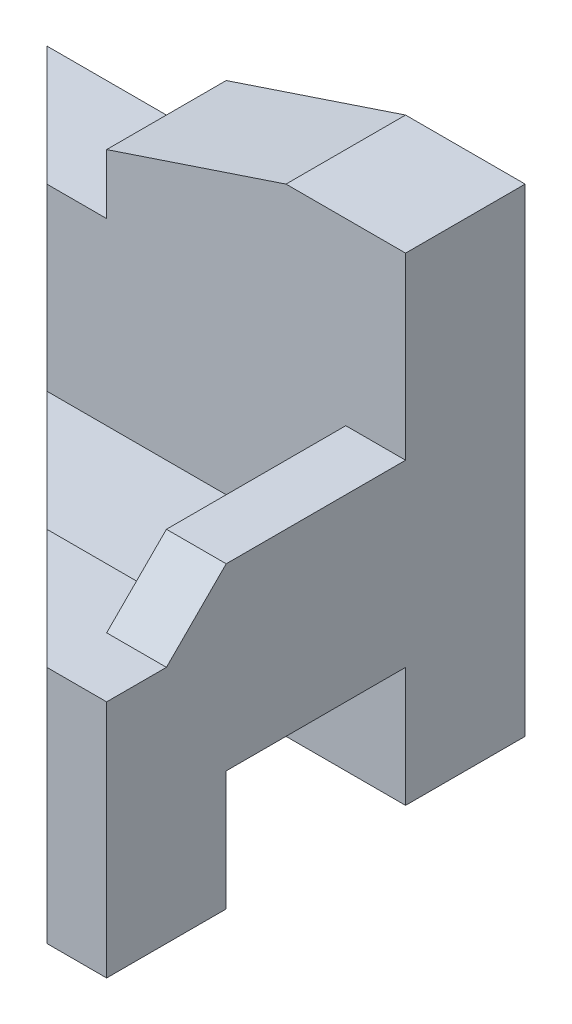
ISO-10303-21;
HEADER;
FILE_DESCRIPTION(('STEP AP214'),'2;1');
FILE_NAME('part.step','',(''),(''),'','','');
FILE_SCHEMA(('AUTOMOTIVE_DESIGN { 1 0 10303 214 1 1 1 1 }'));
ENDSEC;
DATA;
#1=APPLICATION_CONTEXT('core data for automotive mechanical design processes');
#2=APPLICATION_PROTOCOL_DEFINITION('international standard','automotive_design',2000,#1);
#3=PRODUCT_CONTEXT('',#1,'mechanical');
#4=PRODUCT('Part','Part','',(#3));
#5=PRODUCT_RELATED_PRODUCT_CATEGORY('part','',(#4));
#6=PRODUCT_DEFINITION_FORMATION('','',#4);
#7=PRODUCT_DEFINITION_CONTEXT('part definition',#1,'design');
#8=PRODUCT_DEFINITION('design','',#6,#7);
#9=PRODUCT_DEFINITION_SHAPE('','',#8);
#10=(LENGTH_UNIT() NAMED_UNIT(*) SI_UNIT(.MILLI.,.METRE.));
#11=(NAMED_UNIT(*) PLANE_ANGLE_UNIT() SI_UNIT($,.RADIAN.));
#12=(NAMED_UNIT(*) SI_UNIT($,.STERADIAN.) SOLID_ANGLE_UNIT());
#13=UNCERTAINTY_MEASURE_WITH_UNIT(LENGTH_MEASURE(1.E-05),#10,'distance_accuracy_value','');
#14=(GEOMETRIC_REPRESENTATION_CONTEXT(3) GLOBAL_UNCERTAINTY_ASSIGNED_CONTEXT((#13)) GLOBAL_UNIT_ASSIGNED_CONTEXT((#10,
#11,#12)) REPRESENTATION_CONTEXT('',''));
#15=CARTESIAN_POINT('',(0.,0.,0.));
#16=DIRECTION('',(0.,0.,1.));
#17=DIRECTION('',(1.,0.,0.));
#18=AXIS2_PLACEMENT_3D('',#15,#16,#17);
#19=CARTESIAN_POINT('',(0.,0.,10.));
#20=DIRECTION('',(0.,0.,1.));
#21=DIRECTION('',(1.,0.,0.));
#22=AXIS2_PLACEMENT_3D('',#19,#20,#21);
#23=PLANE('',#22);
#24=DIRECTION('',(0.,-1.,0.));
#25=VECTOR('',#24,1.);
#26=CARTESIAN_POINT('',(15.,4.99999999999999,10.));
#27=LINE('',#26,#25);
#28=CARTESIAN_POINT('',(15.,4.99999999999999,10.));
#29=VERTEX_POINT('',#28);
#30=CARTESIAN_POINT('',(15.,-5.,10.));
#31=VERTEX_POINT('',#30);
#32=EDGE_CURVE('E290',#29,#31,#27,.T.);
#33=ORIENTED_EDGE('',*,*,#32,.F.);
#34=DIRECTION('',(-1.,0.,0.));
#35=VECTOR('',#34,1.);
#36=CARTESIAN_POINT('',(20.,5.,10.));
#37=LINE('',#36,#35);
#38=CARTESIAN_POINT('',(20.,5.,10.));
#39=VERTEX_POINT('',#38);
#40=EDGE_CURVE('E289',#39,#29,#37,.T.);
#41=ORIENTED_EDGE('',*,*,#40,.F.);
#42=DIRECTION('',(0.,1.,0.));
#43=VECTOR('',#42,1.);
#44=CARTESIAN_POINT('',(20.,20.,10.));
#45=LINE('',#44,#43);
#46=CARTESIAN_POINT('',(20.,20.,10.));
#47=VERTEX_POINT('',#46);
#48=EDGE_CURVE('E37',#39,#47,#45,.T.);
#49=ORIENTED_EDGE('',*,*,#48,.T.);
#50=DIRECTION('',(-1.,0.,0.));
#51=VECTOR('',#50,1.);
#52=CARTESIAN_POINT('',(-20.,20.,10.));
#53=LINE('',#52,#51);
#54=CARTESIAN_POINT('',(10.,20.,10.));
#55=VERTEX_POINT('',#54);
#56=EDGE_CURVE('E247',#47,#55,#53,.T.);
#57=ORIENTED_EDGE('',*,*,#56,.T.);
#58=DIRECTION('',(0.948683298050514,0.316227766016838,0.));
#59=VECTOR('',#58,1.);
#60=CARTESIAN_POINT('',(10.,20.,10.));
#61=LINE('',#60,#59);
#62=CARTESIAN_POINT('',(-5.,15.,10.));
#63=VERTEX_POINT('',#62);
#64=EDGE_CURVE('E234',#63,#55,#61,.T.);
#65=ORIENTED_EDGE('',*,*,#64,.F.);
#66=DIRECTION('',(0.,1.,0.));
#67=VECTOR('',#66,1.);
#68=CARTESIAN_POINT('',(-5.,15.,10.));
#69=LINE('',#68,#67);
#70=CARTESIAN_POINT('',(-5.,9.99999999999999,10.));
#71=VERTEX_POINT('',#70);
#72=EDGE_CURVE('E181',#71,#63,#69,.T.);
#73=ORIENTED_EDGE('',*,*,#72,.F.);
#74=DIRECTION('',(1.,0.,0.));
#75=VECTOR('',#74,1.);
#76=CARTESIAN_POINT('',(-5.,9.99999999999999,10.));
#77=LINE('',#76,#75);
#78=CARTESIAN_POINT('',(-9.99999999999999,9.99999999999999,10.));
#79=VERTEX_POINT('',#78);
#80=EDGE_CURVE('E179',#79,#71,#77,.T.);
#81=ORIENTED_EDGE('',*,*,#80,.F.);
#82=DIRECTION('',(0.,1.,0.));
#83=VECTOR('',#82,1.);
#84=CARTESIAN_POINT('',(-10.,0.,10.));
#85=LINE('',#84,#83);
#86=CARTESIAN_POINT('',(-10.,-5.,10.));
#87=VERTEX_POINT('',#86);
#88=EDGE_CURVE('E319',#87,#79,#85,.T.);
#89=ORIENTED_EDGE('',*,*,#88,.F.);
#90=DIRECTION('',(-1.,0.,0.));
#91=VECTOR('',#90,1.);
#92=CARTESIAN_POINT('',(20.00005,-5.,10.));
#93=LINE('',#92,#91);
#94=EDGE_CURVE('E214',#31,#87,#93,.T.);
#95=ORIENTED_EDGE('',*,*,#94,.F.);
#96=EDGE_LOOP('',(#33,#41,#49,#57,#65,#73,#81,#89,#95));
#97=FACE_BOUND('',#96,.T.);
#98=ADVANCED_FACE('F33',(#97),#23,.T.);
#99=CARTESIAN_POINT('',(-20.,0.,35.));
#100=DIRECTION('',(0.,-1.,0.));
#101=DIRECTION('',(0.,0.,-1.));
#102=AXIS2_PLACEMENT_3D('',#99,#100,#101);
#103=PLANE('',#102);
#104=DIRECTION('',(0.,0.,1.));
#105=VECTOR('',#104,1.);
#106=CARTESIAN_POINT('',(15.,0.,35.));
#107=LINE('',#106,#105);
#108=CARTESIAN_POINT('',(15.,0.,25.));
#109=VERTEX_POINT('',#108);
#110=CARTESIAN_POINT('',(15.,0.,30.));
#111=VERTEX_POINT('',#110);
#112=EDGE_CURVE('E199',#109,#111,#107,.T.);
#113=ORIENTED_EDGE('',*,*,#112,.F.);
#114=DIRECTION('',(-1.,0.,0.));
#115=VECTOR('',#114,1.);
#116=CARTESIAN_POINT('',(-20.,0.,25.));
#117=LINE('',#116,#115);
#118=CARTESIAN_POINT('',(5.,0.,25.));
#119=VERTEX_POINT('',#118);
#120=EDGE_CURVE('E191',#109,#119,#117,.T.);
#121=ORIENTED_EDGE('',*,*,#120,.T.);
#122=DIRECTION('',(0.707106781186547,0.,0.707106781186548));
#123=VECTOR('',#122,1.);
#124=CARTESIAN_POINT('',(-2.5,0.,17.5));
#125=LINE('',#124,#123);
#126=CARTESIAN_POINT('',(15.,0.,35.));
#127=VERTEX_POINT('',#126);
#128=EDGE_CURVE('E317',#119,#127,#125,.T.);
#129=ORIENTED_EDGE('',*,*,#128,.T.);
#130=DIRECTION('',(-1.,0.,0.));
#131=VECTOR('',#130,1.);
#132=CARTESIAN_POINT('',(-20.,0.,35.));
#133=LINE('',#132,#131);
#134=CARTESIAN_POINT('',(20.,0.,35.));
#135=VERTEX_POINT('',#134);
#136=EDGE_CURVE('E178',#135,#127,#133,.T.);
#137=ORIENTED_EDGE('',*,*,#136,.F.);
#138=DIRECTION('',(0.,0.,-1.));
#139=VECTOR('',#138,1.);
#140=CARTESIAN_POINT('',(20.,0.,35.));
#141=LINE('',#140,#139);
#142=CARTESIAN_POINT('',(20.,0.,30.));
#143=VERTEX_POINT('',#142);
#144=EDGE_CURVE('E169',#135,#143,#141,.T.);
#145=ORIENTED_EDGE('',*,*,#144,.T.);
#146=DIRECTION('',(-1.,0.,0.));
#147=VECTOR('',#146,1.);
#148=CARTESIAN_POINT('',(-20.,0.,30.));
#149=LINE('',#148,#147);
#150=EDGE_CURVE('E11',#143,#111,#149,.T.);
#151=ORIENTED_EDGE('',*,*,#150,.T.);
#152=EDGE_LOOP('',(#113,#121,#129,#137,#145,#151));
#153=FACE_BOUND('',#152,.T.);
#154=ADVANCED_FACE('F175',(#153),#103,.F.);
#155=CARTESIAN_POINT('',(20.00005,-5.,10.));
#156=DIRECTION('',(0.,-1.,0.));
#157=DIRECTION('',(0.,0.,-1.));
#158=AXIS2_PLACEMENT_3D('',#155,#156,#157);
#159=PLANE('',#158);
#160=DIRECTION('',(0.,0.,-1.));
#161=VECTOR('',#160,1.);
#162=CARTESIAN_POINT('',(15.,-5.,30.));
#163=LINE('',#162,#161);
#164=CARTESIAN_POINT('',(15.,-5.,25.));
#165=VERTEX_POINT('',#164);
#166=EDGE_CURVE('E200',#165,#31,#163,.T.);
#167=ORIENTED_EDGE('',*,*,#166,.T.);
#168=ORIENTED_EDGE('',*,*,#94,.T.);
#169=DIRECTION('',(0.707106781186547,0.,0.707106781186548));
#170=VECTOR('',#169,1.);
#171=CARTESIAN_POINT('',(5.000025,-5.,25.000025));
#172=LINE('',#171,#170);
#173=CARTESIAN_POINT('',(5.,-5.,25.));
#174=VERTEX_POINT('',#173);
#175=EDGE_CURVE('E212',#87,#174,#172,.T.);
#176=ORIENTED_EDGE('',*,*,#175,.T.);
#177=DIRECTION('',(-1.,0.,0.));
#178=VECTOR('',#177,1.);
#179=CARTESIAN_POINT('',(20.00005,-5.,25.));
#180=LINE('',#179,#178);
#181=EDGE_CURVE('E205',#165,#174,#180,.T.);
#182=ORIENTED_EDGE('',*,*,#181,.F.);
#183=EDGE_LOOP('',(#167,#168,#176,#182));
#184=FACE_BOUND('',#183,.T.);
#185=ADVANCED_FACE('F209',(#184),#159,.F.);
#186=CARTESIAN_POINT('',(20.00005,-5.,25.));
#187=DIRECTION('',(0.,0.,1.));
#188=DIRECTION('',(1.,0.,0.));
#189=AXIS2_PLACEMENT_3D('',#186,#187,#188);
#190=PLANE('',#189);
#191=DIRECTION('',(0.,1.,0.));
#192=VECTOR('',#191,1.);
#193=CARTESIAN_POINT('',(15.,-5.,25.));
#194=LINE('',#193,#192);
#195=EDGE_CURVE('E43',#165,#109,#194,.T.);
#196=ORIENTED_EDGE('',*,*,#195,.F.);
#197=ORIENTED_EDGE('',*,*,#181,.T.);
#198=DIRECTION('',(0.,1.,0.));
#199=VECTOR('',#198,1.);
#200=CARTESIAN_POINT('',(5.,-5.00000000000001,25.));
#201=LINE('',#200,#199);
#202=EDGE_CURVE('E314',#174,#119,#201,.T.);
#203=ORIENTED_EDGE('',*,*,#202,.T.);
#204=ORIENTED_EDGE('',*,*,#120,.F.);
#205=EDGE_LOOP('',(#196,#197,#203,#204));
#206=FACE_BOUND('',#205,.T.);
#207=ADVANCED_FACE('F203',(#206),#190,.F.);
#208=CARTESIAN_POINT('',(-20.,-20.,10.));
#209=DIRECTION('',(0.,1.,0.));
#210=DIRECTION('',(0.,0.,1.));
#211=AXIS2_PLACEMENT_3D('',#208,#209,#210);
#212=PLANE('',#211);
#213=DIRECTION('',(-1.,0.,0.));
#214=VECTOR('',#213,1.);
#215=CARTESIAN_POINT('',(20.,-20.,10.));
#216=LINE('',#215,#214);
#217=CARTESIAN_POINT('',(20.,-20.,10.));
#218=VERTEX_POINT('',#217);
#219=CARTESIAN_POINT('',(-9.99999999999999,-20.,10.));
#220=VERTEX_POINT('',#219);
#221=EDGE_CURVE('E217',#218,#220,#216,.T.);
#222=ORIENTED_EDGE('',*,*,#221,.T.);
#223=DIRECTION('',(-0.707106781186548,0.,-0.707106781186548));
#224=VECTOR('',#223,1.);
#225=CARTESIAN_POINT('',(-20.,-20.,0.));
#226=LINE('',#225,#224);
#227=CARTESIAN_POINT('',(-20.,-20.,0.));
#228=VERTEX_POINT('',#227);
#229=EDGE_CURVE('E277',#220,#228,#226,.T.);
#230=ORIENTED_EDGE('',*,*,#229,.T.);
#231=DIRECTION('',(1.,0.,0.));
#232=VECTOR('',#231,1.);
#233=CARTESIAN_POINT('',(-20.,-20.,0.));
#234=LINE('',#233,#232);
#235=CARTESIAN_POINT('',(20.,-20.,0.));
#236=VERTEX_POINT('',#235);
#237=EDGE_CURVE('E258',#228,#236,#234,.T.);
#238=ORIENTED_EDGE('',*,*,#237,.T.);
#239=DIRECTION('',(0.,0.,-1.));
#240=VECTOR('',#239,1.);
#241=CARTESIAN_POINT('',(20.,-20.,10.));
#242=LINE('',#241,#240);
#243=EDGE_CURVE('E250',#218,#236,#242,.T.);
#244=ORIENTED_EDGE('',*,*,#243,.F.);
#245=EDGE_LOOP('',(#222,#230,#238,#244));
#246=FACE_BOUND('',#245,.T.);
#247=ADVANCED_FACE('F276',(#246),#212,.F.);
#248=CARTESIAN_POINT('',(-20.,20.,10.));
#249=DIRECTION('',(0.,-1.,0.));
#250=DIRECTION('',(0.,0.,-1.));
#251=AXIS2_PLACEMENT_3D('',#248,#249,#250);
#252=PLANE('',#251);
#253=DIRECTION('',(-1.,0.,0.));
#254=VECTOR('',#253,1.);
#255=CARTESIAN_POINT('',(-20.,20.,0.));
#256=LINE('',#255,#254);
#257=CARTESIAN_POINT('',(20.,20.,0.));
#258=VERTEX_POINT('',#257);
#259=CARTESIAN_POINT('',(10.,20.,0.));
#260=VERTEX_POINT('',#259);
#261=EDGE_CURVE('E253',#258,#260,#256,.T.);
#262=ORIENTED_EDGE('',*,*,#261,.T.);
#263=DIRECTION('',(0.,0.,1.));
#264=VECTOR('',#263,1.);
#265=CARTESIAN_POINT('',(10.,20.,0.));
#266=LINE('',#265,#264);
#267=EDGE_CURVE('E240',#260,#55,#266,.T.);
#268=ORIENTED_EDGE('',*,*,#267,.T.);
#269=ORIENTED_EDGE('',*,*,#56,.F.);
#270=DIRECTION('',(0.,0.,-1.));
#271=VECTOR('',#270,1.);
#272=CARTESIAN_POINT('',(20.,20.,10.));
#273=LINE('',#272,#271);
#274=EDGE_CURVE('E187',#47,#258,#273,.T.);
#275=ORIENTED_EDGE('',*,*,#274,.T.);
#276=EDGE_LOOP('',(#262,#268,#269,#275));
#277=FACE_BOUND('',#276,.T.);
#278=ADVANCED_FACE('F284',(#277),#252,.F.);
#279=CARTESIAN_POINT('',(20.,20.,10.));
#280=DIRECTION('',(-1.,0.,0.));
#281=DIRECTION('',(0.,0.,1.));
#282=AXIS2_PLACEMENT_3D('',#279,#280,#281);
#283=PLANE('',#282);
#284=DIRECTION('',(0.,0.,-1.));
#285=VECTOR('',#284,1.);
#286=CARTESIAN_POINT('',(20.,5.,30.));
#287=LINE('',#286,#285);
#288=CARTESIAN_POINT('',(20.,5.,25.));
#289=VERTEX_POINT('',#288);
#290=EDGE_CURVE('E172',#289,#39,#287,.T.);
#291=ORIENTED_EDGE('',*,*,#290,.F.);
#292=DIRECTION('',(0.,-0.707106781186547,0.707106781186548));
#293=VECTOR('',#292,1.);
#294=CARTESIAN_POINT('',(20.,0.,30.));
#295=LINE('',#294,#293);
#296=EDGE_CURVE('E50',#289,#143,#295,.T.);
#297=ORIENTED_EDGE('',*,*,#296,.T.);
#298=ORIENTED_EDGE('',*,*,#144,.F.);
#299=DIRECTION('',(0.,1.,0.));
#300=VECTOR('',#299,1.);
#301=CARTESIAN_POINT('',(20.,0.,35.));
#302=LINE('',#301,#300);
#303=CARTESIAN_POINT('',(20.,-20.,35.));
#304=VERTEX_POINT('',#303);
#305=EDGE_CURVE('E183',#304,#135,#302,.T.);
#306=ORIENTED_EDGE('',*,*,#305,.F.);
#307=CARTESIAN_POINT('',(20.,-20.,25.));
#308=VERTEX_POINT('',#307);
#309=EDGE_CURVE('E260',#304,#308,#242,.T.);
#310=ORIENTED_EDGE('',*,*,#309,.T.);
#311=DIRECTION('',(0.,1.,0.));
#312=VECTOR('',#311,1.);
#313=CARTESIAN_POINT('',(20.,-10.,25.));
#314=LINE('',#313,#312);
#315=CARTESIAN_POINT('',(20.,-10.,25.));
#316=VERTEX_POINT('',#315);
#317=EDGE_CURVE('E321',#308,#316,#314,.T.);
#318=ORIENTED_EDGE('',*,*,#317,.T.);
#319=DIRECTION('',(0.,0.,-1.));
#320=VECTOR('',#319,1.);
#321=CARTESIAN_POINT('',(20.,-10.,10.));
#322=LINE('',#321,#320);
#323=CARTESIAN_POINT('',(20.,-10.,10.));
#324=VERTEX_POINT('',#323);
#325=EDGE_CURVE('E323',#316,#324,#322,.T.);
#326=ORIENTED_EDGE('',*,*,#325,.T.);
#327=DIRECTION('',(0.,-1.,0.));
#328=VECTOR('',#327,1.);
#329=CARTESIAN_POINT('',(20.,-20.,10.));
#330=LINE('',#329,#328);
#331=EDGE_CURVE('E271',#324,#218,#330,.T.);
#332=ORIENTED_EDGE('',*,*,#331,.T.);
#333=ORIENTED_EDGE('',*,*,#243,.T.);
#334=DIRECTION('',(0.,1.,0.));
#335=VECTOR('',#334,1.);
#336=CARTESIAN_POINT('',(20.,20.,0.));
#337=LINE('',#336,#335);
#338=EDGE_CURVE('E243',#236,#258,#337,.T.);
#339=ORIENTED_EDGE('',*,*,#338,.T.);
#340=ORIENTED_EDGE('',*,*,#274,.F.);
#341=ORIENTED_EDGE('',*,*,#48,.F.);
#342=EDGE_LOOP('',(#291,#297,#298,#306,#310,#318,#326,#332,#333,#339,#340,#341));
#343=FACE_BOUND('',#342,.T.);
#344=ADVANCED_FACE('F35',(#343),#283,.F.);
#345=DIRECTION('',(1.,0.,0.));
#346=VECTOR('',#345,1.);
#347=CARTESIAN_POINT('',(20.,-20.,35.));
#348=LINE('',#347,#346);
#349=CARTESIAN_POINT('',(15.,-20.,35.));
#350=VERTEX_POINT('',#349);
#351=EDGE_CURVE('E213',#350,#304,#348,.T.);
#352=ORIENTED_EDGE('',*,*,#351,.F.);
#353=CARTESIAN_POINT('',(5.00000000000001,-20.,25.));
#354=VERTEX_POINT('',#353);
#355=EDGE_CURVE('E302',#350,#354,#226,.T.);
#356=ORIENTED_EDGE('',*,*,#355,.T.);
#357=DIRECTION('',(-1.,0.,0.));
#358=VECTOR('',#357,1.);
#359=CARTESIAN_POINT('',(20.,-20.,25.));
#360=LINE('',#359,#358);
#361=EDGE_CURVE('E220',#308,#354,#360,.T.);
#362=ORIENTED_EDGE('',*,*,#361,.F.);
#363=ORIENTED_EDGE('',*,*,#309,.F.);
#364=EDGE_LOOP('',(#352,#356,#362,#363));
#365=FACE_BOUND('',#364,.T.);
#366=ADVANCED_FACE('F339',(#365),#212,.F.);
#367=CARTESIAN_POINT('',(0.,0.,0.));
#368=DIRECTION('',(0.,0.,1.));
#369=DIRECTION('',(1.,0.,0.));
#370=AXIS2_PLACEMENT_3D('',#367,#368,#369);
#371=PLANE('',#370);
#372=DIRECTION('',(1.,0.,0.));
#373=VECTOR('',#372,1.);
#374=CARTESIAN_POINT('',(-5.,9.99999999999999,0.));
#375=LINE('',#374,#373);
#376=CARTESIAN_POINT('',(-20.,9.99999999999999,0.));
#377=VERTEX_POINT('',#376);
#378=CARTESIAN_POINT('',(-5.,9.99999999999999,0.));
#379=VERTEX_POINT('',#378);
#380=EDGE_CURVE('E227',#377,#379,#375,.T.);
#381=ORIENTED_EDGE('',*,*,#380,.T.);
#382=DIRECTION('',(0.,1.,0.));
#383=VECTOR('',#382,1.);
#384=CARTESIAN_POINT('',(-5.,20.,0.));
#385=LINE('',#384,#383);
#386=CARTESIAN_POINT('',(-5.,15.,0.));
#387=VERTEX_POINT('',#386);
#388=EDGE_CURVE('E224',#379,#387,#385,.T.);
#389=ORIENTED_EDGE('',*,*,#388,.T.);
#390=DIRECTION('',(0.948683298050514,0.316227766016838,0.));
#391=VECTOR('',#390,1.);
#392=CARTESIAN_POINT('',(10.,20.,0.));
#393=LINE('',#392,#391);
#394=EDGE_CURVE('E235',#387,#260,#393,.T.);
#395=ORIENTED_EDGE('',*,*,#394,.T.);
#396=ORIENTED_EDGE('',*,*,#261,.F.);
#397=ORIENTED_EDGE('',*,*,#338,.F.);
#398=ORIENTED_EDGE('',*,*,#237,.F.);
#399=DIRECTION('',(0.,-1.,0.));
#400=VECTOR('',#399,1.);
#401=CARTESIAN_POINT('',(-20.,20.,0.));
#402=LINE('',#401,#400);
#403=EDGE_CURVE('E256',#377,#228,#402,.T.);
#404=ORIENTED_EDGE('',*,*,#403,.F.);
#405=EDGE_LOOP('',(#381,#389,#395,#396,#397,#398,#404));
#406=FACE_BOUND('',#405,.T.);
#407=ADVANCED_FACE('F280',(#406),#371,.F.);
#408=CARTESIAN_POINT('',(10.,20.,0.));
#409=DIRECTION('',(0.316227766016838,-0.948683298050514,0.));
#410=DIRECTION('',(0.948683298050514,0.316227766016838,0.));
#411=AXIS2_PLACEMENT_3D('',#408,#409,#410);
#412=PLANE('',#411);
#413=ORIENTED_EDGE('',*,*,#64,.T.);
#414=ORIENTED_EDGE('',*,*,#267,.F.);
#415=ORIENTED_EDGE('',*,*,#394,.F.);
#416=DIRECTION('',(0.,0.,1.));
#417=VECTOR('',#416,1.);
#418=CARTESIAN_POINT('',(-5.,15.,0.));
#419=LINE('',#418,#417);
#420=EDGE_CURVE('E238',#387,#63,#419,.T.);
#421=ORIENTED_EDGE('',*,*,#420,.T.);
#422=EDGE_LOOP('',(#413,#414,#415,#421));
#423=FACE_BOUND('',#422,.T.);
#424=ADVANCED_FACE('F369',(#423),#412,.F.);
#425=CARTESIAN_POINT('',(-5.,15.,0.));
#426=DIRECTION('',(1.,0.,0.));
#427=DIRECTION('',(0.,1.,0.));
#428=AXIS2_PLACEMENT_3D('',#425,#426,#427);
#429=PLANE('',#428);
#430=ORIENTED_EDGE('',*,*,#388,.F.);
#431=DIRECTION('',(0.,0.,1.));
#432=VECTOR('',#431,1.);
#433=CARTESIAN_POINT('',(-5.,9.99999999999999,0.));
#434=LINE('',#433,#432);
#435=EDGE_CURVE('E229',#379,#71,#434,.T.);
#436=ORIENTED_EDGE('',*,*,#435,.T.);
#437=ORIENTED_EDGE('',*,*,#72,.T.);
#438=ORIENTED_EDGE('',*,*,#420,.F.);
#439=EDGE_LOOP('',(#430,#436,#437,#438));
#440=FACE_BOUND('',#439,.T.);
#441=ADVANCED_FACE('F357',(#440),#429,.F.);
#442=CARTESIAN_POINT('',(-5.,9.99999999999999,0.));
#443=DIRECTION('',(0.,-1.,0.));
#444=DIRECTION('',(1.,0.,0.));
#445=AXIS2_PLACEMENT_3D('',#442,#443,#444);
#446=PLANE('',#445);
#447=ORIENTED_EDGE('',*,*,#380,.F.);
#448=DIRECTION('',(-0.707106781186548,0.,-0.707106781186548));
#449=VECTOR('',#448,1.);
#450=CARTESIAN_POINT('',(-20.,9.99999999999999,0.));
#451=LINE('',#450,#449);
#452=EDGE_CURVE('E301',#79,#377,#451,.T.);
#453=ORIENTED_EDGE('',*,*,#452,.F.);
#454=ORIENTED_EDGE('',*,*,#80,.T.);
#455=ORIENTED_EDGE('',*,*,#435,.F.);
#456=EDGE_LOOP('',(#447,#453,#454,#455));
#457=FACE_BOUND('',#456,.T.);
#458=ADVANCED_FACE('F348',(#457),#446,.F.);
#459=CARTESIAN_POINT('',(0.,0.,35.));
#460=DIRECTION('',(0.,0.,-1.));
#461=DIRECTION('',(-1.,0.,0.));
#462=AXIS2_PLACEMENT_3D('',#459,#460,#461);
#463=PLANE('',#462);
#464=ORIENTED_EDGE('',*,*,#136,.T.);
#465=DIRECTION('',(0.,1.,0.));
#466=VECTOR('',#465,1.);
#467=CARTESIAN_POINT('',(15.,-20.,35.));
#468=LINE('',#467,#466);
#469=EDGE_CURVE('E305',#350,#127,#468,.T.);
#470=ORIENTED_EDGE('',*,*,#469,.F.);
#471=ORIENTED_EDGE('',*,*,#351,.T.);
#472=ORIENTED_EDGE('',*,*,#305,.T.);
#473=EDGE_LOOP('',(#464,#470,#471,#472));
#474=FACE_BOUND('',#473,.T.);
#475=ADVANCED_FACE('F345',(#474),#463,.F.);
#476=CARTESIAN_POINT('',(20.,-20.,10.));
#477=DIRECTION('',(0.,0.,-1.));
#478=DIRECTION('',(-1.,0.,0.));
#479=AXIS2_PLACEMENT_3D('',#476,#477,#478);
#480=PLANE('',#479);
#481=DIRECTION('',(-1.,0.,0.));
#482=VECTOR('',#481,1.);
#483=CARTESIAN_POINT('',(20.,-10.,10.));
#484=LINE('',#483,#482);
#485=CARTESIAN_POINT('',(-9.99999999999999,-10.,10.));
#486=VERTEX_POINT('',#485);
#487=EDGE_CURVE('E327',#324,#486,#484,.T.);
#488=ORIENTED_EDGE('',*,*,#487,.T.);
#489=DIRECTION('',(0.,-1.,0.));
#490=VECTOR('',#489,1.);
#491=CARTESIAN_POINT('',(-9.99999999999999,-20.,10.));
#492=LINE('',#491,#490);
#493=EDGE_CURVE('E311',#486,#220,#492,.T.);
#494=ORIENTED_EDGE('',*,*,#493,.T.);
#495=ORIENTED_EDGE('',*,*,#221,.F.);
#496=ORIENTED_EDGE('',*,*,#331,.F.);
#497=EDGE_LOOP('',(#488,#494,#495,#496));
#498=FACE_BOUND('',#497,.T.);
#499=ADVANCED_FACE('F347',(#498),#480,.F.);
#500=CARTESIAN_POINT('',(20.,-10.,10.));
#501=DIRECTION('',(0.,1.,0.));
#502=DIRECTION('',(0.,0.,1.));
#503=AXIS2_PLACEMENT_3D('',#500,#501,#502);
#504=PLANE('',#503);
#505=DIRECTION('',(-1.,0.,0.));
#506=VECTOR('',#505,1.);
#507=CARTESIAN_POINT('',(20.,-10.,25.));
#508=LINE('',#507,#506);
#509=CARTESIAN_POINT('',(5.00000000000001,-10.,25.));
#510=VERTEX_POINT('',#509);
#511=EDGE_CURVE('E329',#316,#510,#508,.T.);
#512=ORIENTED_EDGE('',*,*,#511,.T.);
#513=DIRECTION('',(-0.707106781186547,0.,-0.707106781186548));
#514=VECTOR('',#513,1.);
#515=CARTESIAN_POINT('',(5.,-10.,25.));
#516=LINE('',#515,#514);
#517=EDGE_CURVE('E308',#510,#486,#516,.T.);
#518=ORIENTED_EDGE('',*,*,#517,.T.);
#519=ORIENTED_EDGE('',*,*,#487,.F.);
#520=ORIENTED_EDGE('',*,*,#325,.F.);
#521=EDGE_LOOP('',(#512,#518,#519,#520));
#522=FACE_BOUND('',#521,.T.);
#523=ADVANCED_FACE('F354',(#522),#504,.F.);
#524=CARTESIAN_POINT('',(20.,-10.,25.));
#525=DIRECTION('',(0.,0.,1.));
#526=DIRECTION('',(0.,-1.,0.));
#527=AXIS2_PLACEMENT_3D('',#524,#525,#526);
#528=PLANE('',#527);
#529=ORIENTED_EDGE('',*,*,#361,.T.);
#530=DIRECTION('',(0.,1.,0.));
#531=VECTOR('',#530,1.);
#532=CARTESIAN_POINT('',(5.,-10.,25.));
#533=LINE('',#532,#531);
#534=EDGE_CURVE('E193',#354,#510,#533,.T.);
#535=ORIENTED_EDGE('',*,*,#534,.T.);
#536=ORIENTED_EDGE('',*,*,#511,.F.);
#537=ORIENTED_EDGE('',*,*,#317,.F.);
#538=EDGE_LOOP('',(#529,#535,#536,#537));
#539=FACE_BOUND('',#538,.T.);
#540=ADVANCED_FACE('F336',(#539),#528,.F.);
#541=CARTESIAN_POINT('',(-20.,-20.,0.));
#542=DIRECTION('',(0.707106781186548,0.,-0.707106781186547));
#543=DIRECTION('',(-0.707106781186547,0.,-0.707106781186548));
#544=AXIS2_PLACEMENT_3D('',#541,#542,#543);
#545=PLANE('',#544);
#546=ORIENTED_EDGE('',*,*,#88,.T.);
#547=ORIENTED_EDGE('',*,*,#452,.T.);
#548=ORIENTED_EDGE('',*,*,#403,.T.);
#549=ORIENTED_EDGE('',*,*,#229,.F.);
#550=ORIENTED_EDGE('',*,*,#493,.F.);
#551=ORIENTED_EDGE('',*,*,#517,.F.);
#552=ORIENTED_EDGE('',*,*,#534,.F.);
#553=ORIENTED_EDGE('',*,*,#355,.F.);
#554=ORIENTED_EDGE('',*,*,#469,.T.);
#555=ORIENTED_EDGE('',*,*,#128,.F.);
#556=ORIENTED_EDGE('',*,*,#202,.F.);
#557=ORIENTED_EDGE('',*,*,#175,.F.);
#558=EDGE_LOOP('',(#546,#547,#548,#549,#550,#551,#552,#553,#554,#555,#556,#557));
#559=FACE_BOUND('',#558,.T.);
#560=ADVANCED_FACE('F342',(#559),#545,.F.);
#561=CARTESIAN_POINT('',(15.,4.99999999999999,30.));
#562=DIRECTION('',(1.,0.,0.));
#563=DIRECTION('',(0.,0.,-1.));
#564=AXIS2_PLACEMENT_3D('',#561,#562,#563);
#565=PLANE('',#564);
#566=ORIENTED_EDGE('',*,*,#112,.T.);
#567=DIRECTION('',(0.,-0.707106781186547,0.707106781186548));
#568=VECTOR('',#567,1.);
#569=CARTESIAN_POINT('',(15.,0.,30.));
#570=LINE('',#569,#568);
#571=CARTESIAN_POINT('',(15.,4.99999999999999,25.));
#572=VERTEX_POINT('',#571);
#573=EDGE_CURVE('E160',#572,#111,#570,.T.);
#574=ORIENTED_EDGE('',*,*,#573,.F.);
#575=DIRECTION('',(0.,0.,-1.));
#576=VECTOR('',#575,1.);
#577=CARTESIAN_POINT('',(15.,4.99999999999999,30.));
#578=LINE('',#577,#576);
#579=EDGE_CURVE('E58',#572,#29,#578,.T.);
#580=ORIENTED_EDGE('',*,*,#579,.T.);
#581=ORIENTED_EDGE('',*,*,#32,.T.);
#582=ORIENTED_EDGE('',*,*,#166,.F.);
#583=ORIENTED_EDGE('',*,*,#195,.T.);
#584=EDGE_LOOP('',(#566,#574,#580,#581,#582,#583));
#585=FACE_BOUND('',#584,.T.);
#586=ADVANCED_FACE('F198',(#585),#565,.F.);
#587=CARTESIAN_POINT('',(20.,5.,30.));
#588=DIRECTION('',(0.,-1.,0.));
#589=DIRECTION('',(1.,0.,0.));
#590=AXIS2_PLACEMENT_3D('',#587,#588,#589);
#591=PLANE('',#590);
#592=ORIENTED_EDGE('',*,*,#579,.F.);
#593=DIRECTION('',(-1.,0.,0.));
#594=VECTOR('',#593,1.);
#595=CARTESIAN_POINT('',(20.,4.99999999999999,25.));
#596=LINE('',#595,#594);
#597=EDGE_CURVE('E173',#289,#572,#596,.T.);
#598=ORIENTED_EDGE('',*,*,#597,.F.);
#599=ORIENTED_EDGE('',*,*,#290,.T.);
#600=ORIENTED_EDGE('',*,*,#40,.T.);
#601=EDGE_LOOP('',(#592,#598,#599,#600));
#602=FACE_BOUND('',#601,.T.);
#603=ADVANCED_FACE('F392',(#602),#591,.F.);
#604=CARTESIAN_POINT('',(20.,0.,30.));
#605=DIRECTION('',(0.,-0.707106781186548,-0.707106781186547));
#606=DIRECTION('',(0.,0.707106781186547,-0.707106781186548));
#607=AXIS2_PLACEMENT_3D('',#604,#605,#606);
#608=PLANE('',#607);
#609=ORIENTED_EDGE('',*,*,#573,.T.);
#610=ORIENTED_EDGE('',*,*,#150,.F.);
#611=ORIENTED_EDGE('',*,*,#296,.F.);
#612=ORIENTED_EDGE('',*,*,#597,.T.);
#613=EDGE_LOOP('',(#609,#610,#611,#612));
#614=FACE_BOUND('',#613,.T.);
#615=ADVANCED_FACE('F159',(#614),#608,.F.);
#616=CLOSED_SHELL('',(#98,#154,#185,#207,#247,#278,#344,#366,#407,#424,#441,#458,#475,#499,#523,
#540,#560,#586,#603,#615));
#617=MANIFOLD_SOLID_BREP('B2',#616);
#618=ADVANCED_BREP_SHAPE_REPRESENTATION('',(#18,#617),#14);
#619=SHAPE_DEFINITION_REPRESENTATION(#9,#618);
ENDSEC;
END-ISO-10303-21;
